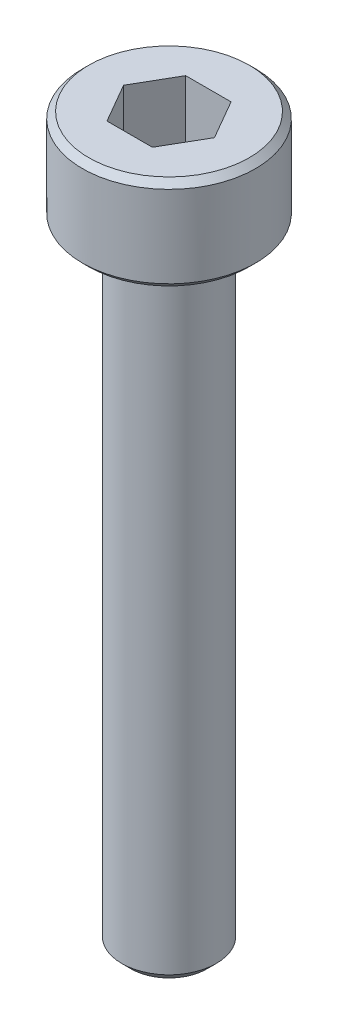
ISO-10303-21;
HEADER;
FILE_DESCRIPTION(('STEP AP214'),'2;1');
FILE_NAME('part.step','',(''),(''),'','','');
FILE_SCHEMA(('AUTOMOTIVE_DESIGN { 1 0 10303 214 1 1 1 1 }'));
ENDSEC;
DATA;
#1=APPLICATION_CONTEXT('core data for automotive mechanical design processes');
#2=APPLICATION_PROTOCOL_DEFINITION('international standard','automotive_design',2000,#1);
#3=PRODUCT_CONTEXT('',#1,'mechanical');
#4=PRODUCT('Part','Part','',(#3));
#5=PRODUCT_RELATED_PRODUCT_CATEGORY('part','',(#4));
#6=PRODUCT_DEFINITION_FORMATION('','',#4);
#7=PRODUCT_DEFINITION_CONTEXT('part definition',#1,'design');
#8=PRODUCT_DEFINITION('design','',#6,#7);
#9=PRODUCT_DEFINITION_SHAPE('','',#8);
#10=(LENGTH_UNIT() NAMED_UNIT(*) SI_UNIT(.MILLI.,.METRE.));
#11=(NAMED_UNIT(*) PLANE_ANGLE_UNIT() SI_UNIT($,.RADIAN.));
#12=(NAMED_UNIT(*) SI_UNIT($,.STERADIAN.) SOLID_ANGLE_UNIT());
#13=UNCERTAINTY_MEASURE_WITH_UNIT(LENGTH_MEASURE(1.E-05),#10,'distance_accuracy_value','');
#14=(GEOMETRIC_REPRESENTATION_CONTEXT(3) GLOBAL_UNCERTAINTY_ASSIGNED_CONTEXT((#13)) GLOBAL_UNIT_ASSIGNED_CONTEXT((#10,
#11,#12)) REPRESENTATION_CONTEXT('',''));
#15=CARTESIAN_POINT('',(0.,0.,0.));
#16=DIRECTION('',(0.,0.,1.));
#17=DIRECTION('',(1.,0.,0.));
#18=AXIS2_PLACEMENT_3D('',#15,#16,#17);
#19=CARTESIAN_POINT('',(0.721687836487033,21.,1.25));
#20=DIRECTION('',(0.866025403784439,0.,0.5));
#21=DIRECTION('',(0.5,0.,-0.866025403784439));
#22=AXIS2_PLACEMENT_3D('',#19,#20,#21);
#23=PLANE('',#22);
#24=DIRECTION('',(0.5,0.,-0.866025403784439));
#25=VECTOR('',#24,1.);
#26=CARTESIAN_POINT('',(0.721687836487033,21.,1.25));
#27=LINE('',#26,#25);
#28=CARTESIAN_POINT('',(0.721687836487033,21.,1.25));
#29=VERTEX_POINT('',#28);
#30=CARTESIAN_POINT('',(1.44337567297406,21.,0.));
#31=VERTEX_POINT('',#30);
#32=EDGE_CURVE('E66',#29,#31,#27,.T.);
#33=ORIENTED_EDGE('',*,*,#32,.F.);
#34=DIRECTION('',(0.,1.,0.));
#35=VECTOR('',#34,1.);
#36=CARTESIAN_POINT('',(0.721687836487033,21.,1.25));
#37=LINE('',#36,#35);
#38=CARTESIAN_POINT('',(0.721687836487033,23.,1.25));
#39=VERTEX_POINT('',#38);
#40=EDGE_CURVE('E85',#29,#39,#37,.T.);
#41=ORIENTED_EDGE('',*,*,#40,.T.);
#42=DIRECTION('',(0.5,0.,-0.866025403784439));
#43=VECTOR('',#42,1.);
#44=CARTESIAN_POINT('',(0.721687836487033,23.,1.25));
#45=LINE('',#44,#43);
#46=CARTESIAN_POINT('',(1.44337567297406,23.,0.));
#47=VERTEX_POINT('',#46);
#48=EDGE_CURVE('E73',#47,#39,#45,.F.);
#49=ORIENTED_EDGE('',*,*,#48,.F.);
#50=DIRECTION('',(0.,1.,0.));
#51=VECTOR('',#50,1.);
#52=CARTESIAN_POINT('',(1.44337567297406,21.,0.));
#53=LINE('',#52,#51);
#54=EDGE_CURVE('E80',#47,#31,#53,.F.);
#55=ORIENTED_EDGE('',*,*,#54,.T.);
#56=EDGE_LOOP('',(#33,#41,#49,#55));
#57=FACE_BOUND('',#56,.T.);
#58=ADVANCED_FACE('F17',(#57),#23,.F.);
#59=CARTESIAN_POINT('',(1.44337567297406,21.,0.));
#60=DIRECTION('',(0.866025403784438,0.,-0.5));
#61=DIRECTION('',(-0.5,0.,-0.866025403784438));
#62=AXIS2_PLACEMENT_3D('',#59,#60,#61);
#63=PLANE('',#62);
#64=DIRECTION('',(-0.5,0.,-0.866025403784438));
#65=VECTOR('',#64,1.);
#66=CARTESIAN_POINT('',(1.44337567297406,21.,0.));
#67=LINE('',#66,#65);
#68=CARTESIAN_POINT('',(0.721687836487031,21.,-1.25));
#69=VERTEX_POINT('',#68);
#70=EDGE_CURVE('E89',#31,#69,#67,.T.);
#71=ORIENTED_EDGE('',*,*,#70,.F.);
#72=ORIENTED_EDGE('',*,*,#54,.F.);
#73=DIRECTION('',(-0.5,0.,-0.866025403784438));
#74=VECTOR('',#73,1.);
#75=CARTESIAN_POINT('',(1.44337567297406,23.,0.));
#76=LINE('',#75,#74);
#77=CARTESIAN_POINT('',(0.721687836487032,23.,-1.25));
#78=VERTEX_POINT('',#77);
#79=EDGE_CURVE('E70',#78,#47,#76,.F.);
#80=ORIENTED_EDGE('',*,*,#79,.F.);
#81=DIRECTION('',(0.,1.,0.));
#82=VECTOR('',#81,1.);
#83=CARTESIAN_POINT('',(0.721687836487031,21.,-1.25));
#84=LINE('',#83,#82);
#85=EDGE_CURVE('E133',#78,#69,#84,.F.);
#86=ORIENTED_EDGE('',*,*,#85,.T.);
#87=EDGE_LOOP('',(#71,#72,#80,#86));
#88=FACE_BOUND('',#87,.T.);
#89=ADVANCED_FACE('F88',(#88),#63,.F.);
#90=CARTESIAN_POINT('',(-0.721687836487032,21.,1.25));
#91=DIRECTION('',(0.,0.,1.));
#92=DIRECTION('',(1.,0.,0.));
#93=AXIS2_PLACEMENT_3D('',#90,#91,#92);
#94=PLANE('',#93);
#95=DIRECTION('',(1.,0.,0.));
#96=VECTOR('',#95,1.);
#97=CARTESIAN_POINT('',(1.44337567297406,21.,1.25));
#98=LINE('',#97,#96);
#99=CARTESIAN_POINT('',(-0.721687836487032,21.,1.25));
#100=VERTEX_POINT('',#99);
#101=EDGE_CURVE('E131',#100,#29,#98,.T.);
#102=ORIENTED_EDGE('',*,*,#101,.F.);
#103=DIRECTION('',(0.,1.,0.));
#104=VECTOR('',#103,1.);
#105=CARTESIAN_POINT('',(-0.721687836487032,21.,1.25));
#106=LINE('',#105,#104);
#107=CARTESIAN_POINT('',(-0.721687836487032,23.,1.25));
#108=VERTEX_POINT('',#107);
#109=EDGE_CURVE('E121',#100,#108,#106,.T.);
#110=ORIENTED_EDGE('',*,*,#109,.T.);
#111=DIRECTION('',(1.,0.,0.));
#112=VECTOR('',#111,1.);
#113=CARTESIAN_POINT('',(-0.721687836487032,23.,1.25));
#114=LINE('',#113,#112);
#115=EDGE_CURVE('E91',#39,#108,#114,.F.);
#116=ORIENTED_EDGE('',*,*,#115,.F.);
#117=ORIENTED_EDGE('',*,*,#40,.F.);
#118=EDGE_LOOP('',(#102,#110,#116,#117));
#119=FACE_BOUND('',#118,.T.);
#120=ADVANCED_FACE('F138',(#119),#94,.F.);
#121=CARTESIAN_POINT('',(0.721687836487031,21.,-1.25));
#122=DIRECTION('',(0.,0.,-1.));
#123=DIRECTION('',(-1.,0.,0.));
#124=AXIS2_PLACEMENT_3D('',#121,#122,#123);
#125=PLANE('',#124);
#126=DIRECTION('',(1.,0.,0.));
#127=VECTOR('',#126,1.);
#128=CARTESIAN_POINT('',(1.44337567297406,21.,-1.25));
#129=LINE('',#128,#127);
#130=CARTESIAN_POINT('',(-0.721687836487032,21.,-1.25));
#131=VERTEX_POINT('',#130);
#132=EDGE_CURVE('E128',#69,#131,#129,.F.);
#133=ORIENTED_EDGE('',*,*,#132,.F.);
#134=ORIENTED_EDGE('',*,*,#85,.F.);
#135=DIRECTION('',(-1.,0.,0.));
#136=VECTOR('',#135,1.);
#137=CARTESIAN_POINT('',(0.721687836487031,23.,-1.25));
#138=LINE('',#137,#136);
#139=CARTESIAN_POINT('',(-0.721687836487032,23.,-1.25));
#140=VERTEX_POINT('',#139);
#141=EDGE_CURVE('E75',#140,#78,#138,.F.);
#142=ORIENTED_EDGE('',*,*,#141,.F.);
#143=DIRECTION('',(0.,1.,0.));
#144=VECTOR('',#143,1.);
#145=CARTESIAN_POINT('',(-0.721687836487032,21.,-1.25));
#146=LINE('',#145,#144);
#147=EDGE_CURVE('E119',#140,#131,#146,.F.);
#148=ORIENTED_EDGE('',*,*,#147,.T.);
#149=EDGE_LOOP('',(#133,#134,#142,#148));
#150=FACE_BOUND('',#149,.T.);
#151=ADVANCED_FACE('F150',(#150),#125,.F.);
#152=CARTESIAN_POINT('',(1.44337567297406,21.,0.));
#153=DIRECTION('',(0.,1.,0.));
#154=DIRECTION('',(0.,0.,1.));
#155=AXIS2_PLACEMENT_3D('',#152,#153,#154);
#156=PLANE('',#155);
#157=ORIENTED_EDGE('',*,*,#132,.T.);
#158=DIRECTION('',(-0.5,0.,0.866025403784439));
#159=VECTOR('',#158,1.);
#160=CARTESIAN_POINT('',(-0.721687836487032,21.,-1.25));
#161=LINE('',#160,#159);
#162=CARTESIAN_POINT('',(-1.44337567297406,21.,0.));
#163=VERTEX_POINT('',#162);
#164=EDGE_CURVE('E117',#131,#163,#161,.T.);
#165=ORIENTED_EDGE('',*,*,#164,.T.);
#166=DIRECTION('',(0.5,0.,0.866025403784438));
#167=VECTOR('',#166,1.);
#168=CARTESIAN_POINT('',(-1.44337567297406,21.,0.));
#169=LINE('',#168,#167);
#170=EDGE_CURVE('E124',#163,#100,#169,.T.);
#171=ORIENTED_EDGE('',*,*,#170,.T.);
#172=ORIENTED_EDGE('',*,*,#101,.T.);
#173=ORIENTED_EDGE('',*,*,#32,.T.);
#174=ORIENTED_EDGE('',*,*,#70,.T.);
#175=EDGE_LOOP('',(#157,#165,#171,#172,#173,#174));
#176=FACE_BOUND('',#175,.T.);
#177=ADVANCED_FACE('F151',(#176),#156,.T.);
#178=CARTESIAN_POINT('',(-1.44337567297406,21.,0.));
#179=DIRECTION('',(-0.866025403784438,0.,0.5));
#180=DIRECTION('',(0.5,0.,0.866025403784438));
#181=AXIS2_PLACEMENT_3D('',#178,#179,#180);
#182=PLANE('',#181);
#183=ORIENTED_EDGE('',*,*,#170,.F.);
#184=DIRECTION('',(0.,1.,0.));
#185=VECTOR('',#184,1.);
#186=CARTESIAN_POINT('',(-1.44337567297407,21.,0.));
#187=LINE('',#186,#185);
#188=CARTESIAN_POINT('',(-1.44337567297406,23.,0.));
#189=VERTEX_POINT('',#188);
#190=EDGE_CURVE('E115',#163,#189,#187,.T.);
#191=ORIENTED_EDGE('',*,*,#190,.T.);
#192=DIRECTION('',(0.5,0.,0.866025403784438));
#193=VECTOR('',#192,1.);
#194=CARTESIAN_POINT('',(-1.44337567297406,23.,0.));
#195=LINE('',#194,#193);
#196=EDGE_CURVE('E35',#108,#189,#195,.F.);
#197=ORIENTED_EDGE('',*,*,#196,.F.);
#198=ORIENTED_EDGE('',*,*,#109,.F.);
#199=EDGE_LOOP('',(#183,#191,#197,#198));
#200=FACE_BOUND('',#199,.T.);
#201=ADVANCED_FACE('F141',(#200),#182,.F.);
#202=CARTESIAN_POINT('',(-0.721687836487032,21.,-1.25));
#203=DIRECTION('',(-0.866025403784439,0.,-0.5));
#204=DIRECTION('',(-0.5,0.,0.866025403784439));
#205=AXIS2_PLACEMENT_3D('',#202,#203,#204);
#206=PLANE('',#205);
#207=ORIENTED_EDGE('',*,*,#164,.F.);
#208=ORIENTED_EDGE('',*,*,#147,.F.);
#209=DIRECTION('',(0.5,0.,-0.866025403784438));
#210=VECTOR('',#209,1.);
#211=CARTESIAN_POINT('',(-1.44337567297406,23.,0.));
#212=LINE('',#211,#210);
#213=EDGE_CURVE('E113',#189,#140,#212,.T.);
#214=ORIENTED_EDGE('',*,*,#213,.F.);
#215=ORIENTED_EDGE('',*,*,#190,.F.);
#216=EDGE_LOOP('',(#207,#208,#214,#215));
#217=FACE_BOUND('',#216,.T.);
#218=ADVANCED_FACE('F147',(#217),#206,.F.);
#219=CARTESIAN_POINT('',(0.,23.,-2.75));
#220=DIRECTION('',(0.,1.,0.));
#221=DIRECTION('',(0.,0.,1.));
#222=AXIS2_PLACEMENT_3D('',#219,#220,#221);
#223=PLANE('',#222);
#224=CARTESIAN_POINT('',(0.,22.9999999999677,0.));
#225=DIRECTION('',(0.,-1.,0.));
#226=DIRECTION('',(0.,0.,-1.));
#227=AXIS2_PLACEMENT_3D('',#224,#225,#226);
#228=CIRCLE('',#227,2.55000000004202);
#229=CARTESIAN_POINT('',(0.,22.9999999999677,-2.55000000004202));
#230=VERTEX_POINT('',#229);
#231=EDGE_CURVE('E20',#230,#230,#228,.T.);
#232=ORIENTED_EDGE('',*,*,#231,.F.);
#233=EDGE_LOOP('',(#232));
#234=FACE_BOUND('',#233,.T.);
#235=ORIENTED_EDGE('',*,*,#196,.T.);
#236=ORIENTED_EDGE('',*,*,#213,.T.);
#237=ORIENTED_EDGE('',*,*,#141,.T.);
#238=ORIENTED_EDGE('',*,*,#79,.T.);
#239=ORIENTED_EDGE('',*,*,#48,.T.);
#240=ORIENTED_EDGE('',*,*,#115,.T.);
#241=EDGE_LOOP('',(#235,#236,#237,#238,#239,#240));
#242=FACE_BOUND('',#241,.T.);
#243=ADVANCED_FACE('F72',(#234,#242),#223,.T.);
#244=CARTESIAN_POINT('',(0.,22.8000000001316,0.));
#245=DIRECTION('',(0.,-1.,0.));
#246=DIRECTION('',(0.,0.,-1.));
#247=AXIS2_PLACEMENT_3D('',#244,#245,#246);
#248=CONICAL_SURFACE('',#247,2.74999999987813,0.785398163397448);
#249=CARTESIAN_POINT('',(0.,22.8,0.));
#250=DIRECTION('',(0.,-1.,0.));
#251=DIRECTION('',(0.,0.,-1.));
#252=AXIS2_PLACEMENT_3D('',#249,#250,#251);
#253=CIRCLE('',#252,2.75);
#254=CARTESIAN_POINT('',(0.,22.8,-2.75));
#255=VERTEX_POINT('',#254);
#256=EDGE_CURVE('E106',#255,#255,#253,.T.);
#257=ORIENTED_EDGE('',*,*,#256,.F.);
#258=EDGE_LOOP('',(#257));
#259=FACE_BOUND('',#258,.T.);
#260=ORIENTED_EDGE('',*,*,#231,.T.);
#261=EDGE_LOOP('',(#260));
#262=FACE_BOUND('',#261,.T.);
#263=ADVANCED_FACE('F186',(#259,#262),#248,.T.);
#264=CARTESIAN_POINT('',(0.,0.,0.));
#265=DIRECTION('',(0.,-1.,0.));
#266=DIRECTION('',(0.,0.,-1.));
#267=AXIS2_PLACEMENT_3D('',#264,#265,#266);
#268=CYLINDRICAL_SURFACE('',#267,2.75);
#269=CARTESIAN_POINT('',(0.,20.1999999999316,0.));
#270=DIRECTION('',(0.,1.,0.));
#271=DIRECTION('',(0.,0.,1.));
#272=AXIS2_PLACEMENT_3D('',#269,#270,#271);
#273=CIRCLE('',#272,2.74999999993497);
#274=CARTESIAN_POINT('',(0.,20.1999999999316,2.74999999993497));
#275=VERTEX_POINT('',#274);
#276=EDGE_CURVE('E102',#275,#275,#273,.F.);
#277=ORIENTED_EDGE('',*,*,#276,.F.);
#278=EDGE_LOOP('',(#277));
#279=FACE_BOUND('',#278,.T.);
#280=ORIENTED_EDGE('',*,*,#256,.T.);
#281=EDGE_LOOP('',(#280));
#282=FACE_BOUND('',#281,.T.);
#283=ADVANCED_FACE('F183',(#279,#282),#268,.T.);
#284=CARTESIAN_POINT('',(0.,20.1999999998179,0.));
#285=DIRECTION('',(0.,1.,0.));
#286=DIRECTION('',(0.,0.,1.));
#287=AXIS2_PLACEMENT_3D('',#284,#285,#286);
#288=CONICAL_SURFACE('',#287,2.74999999982128,0.785398163397448);
#289=ORIENTED_EDGE('',*,*,#276,.T.);
#290=EDGE_LOOP('',(#289));
#291=FACE_BOUND('',#290,.T.);
#292=CARTESIAN_POINT('',(0.,19.999999999925,0.));
#293=DIRECTION('',(0.,1.,0.));
#294=DIRECTION('',(0.,0.,1.));
#295=AXIS2_PLACEMENT_3D('',#292,#293,#294);
#296=CIRCLE('',#295,2.54999999992833);
#297=CARTESIAN_POINT('',(0.,19.999999999925,2.54999999992833));
#298=VERTEX_POINT('',#297);
#299=EDGE_CURVE('E100',#298,#298,#296,.F.);
#300=ORIENTED_EDGE('',*,*,#299,.F.);
#301=EDGE_LOOP('',(#300));
#302=FACE_BOUND('',#301,.T.);
#303=ADVANCED_FACE('F179',(#291,#302),#288,.T.);
#304=CARTESIAN_POINT('',(0.,0.,0.));
#305=DIRECTION('',(0.,-1.,0.));
#306=DIRECTION('',(0.,0.,-1.));
#307=AXIS2_PLACEMENT_3D('',#304,#305,#306);
#308=PLANE('',#307);
#309=CARTESIAN_POINT('',(0.,5.6843418860808E-11,0.));
#310=DIRECTION('',(0.,1.,0.));
#311=DIRECTION('',(0.,0.,1.));
#312=AXIS2_PLACEMENT_3D('',#309,#310,#311);
#313=CIRCLE('',#312,1.20000000003984);
#314=CARTESIAN_POINT('',(0.,5.6843418860808E-11,1.20000000003984));
#315=VERTEX_POINT('',#314);
#316=EDGE_CURVE('E98',#315,#315,#313,.T.);
#317=ORIENTED_EDGE('',*,*,#316,.F.);
#318=EDGE_LOOP('',(#317));
#319=FACE_BOUND('',#318,.T.);
#320=ADVANCED_FACE('F176',(#319),#308,.T.);
#321=CARTESIAN_POINT('',(0.,20.,-1.5));
#322=DIRECTION('',(0.,-1.,0.));
#323=DIRECTION('',(0.,0.,-1.));
#324=AXIS2_PLACEMENT_3D('',#321,#322,#323);
#325=PLANE('',#324);
#326=ORIENTED_EDGE('',*,*,#299,.T.);
#327=EDGE_LOOP('',(#326));
#328=FACE_BOUND('',#327,.T.);
#329=CARTESIAN_POINT('',(0.,20.,0.));
#330=DIRECTION('',(0.,-1.,0.));
#331=DIRECTION('',(0.,0.,-1.));
#332=AXIS2_PLACEMENT_3D('',#329,#330,#331);
#333=CIRCLE('',#332,1.5);
#334=CARTESIAN_POINT('',(0.,20.,-1.5));
#335=VERTEX_POINT('',#334);
#336=EDGE_CURVE('E26',#335,#335,#333,.T.);
#337=ORIENTED_EDGE('',*,*,#336,.F.);
#338=EDGE_LOOP('',(#337));
#339=FACE_BOUND('',#338,.T.);
#340=ADVANCED_FACE('F169',(#328,#339),#325,.T.);
#341=CARTESIAN_POINT('',(0.,0.300000000038381,0.));
#342=DIRECTION('',(0.,1.,0.));
#343=DIRECTION('',(0.,0.,1.));
#344=AXIS2_PLACEMENT_3D('',#341,#342,#343);
#345=CONICAL_SURFACE('',#344,1.50000000002137,0.785398163397448);
#346=CARTESIAN_POINT('',(0.,0.300000000000003,0.));
#347=DIRECTION('',(0.,-1.,0.));
#348=DIRECTION('',(0.,0.,-1.));
#349=AXIS2_PLACEMENT_3D('',#346,#347,#348);
#350=CIRCLE('',#349,1.5);
#351=CARTESIAN_POINT('',(0.,0.300000000000003,-1.5));
#352=VERTEX_POINT('',#351);
#353=EDGE_CURVE('E11',#352,#352,#350,.F.);
#354=ORIENTED_EDGE('',*,*,#353,.F.);
#355=EDGE_LOOP('',(#354));
#356=FACE_BOUND('',#355,.T.);
#357=ORIENTED_EDGE('',*,*,#316,.T.);
#358=EDGE_LOOP('',(#357));
#359=FACE_BOUND('',#358,.T.);
#360=ADVANCED_FACE('F163',(#356,#359),#345,.T.);
#361=CARTESIAN_POINT('',(0.,0.,0.));
#362=DIRECTION('',(0.,-1.,0.));
#363=DIRECTION('',(0.,0.,-1.));
#364=AXIS2_PLACEMENT_3D('',#361,#362,#363);
#365=CYLINDRICAL_SURFACE('',#364,1.5);
#366=ORIENTED_EDGE('',*,*,#353,.T.);
#367=EDGE_LOOP('',(#366));
#368=FACE_BOUND('',#367,.T.);
#369=ORIENTED_EDGE('',*,*,#336,.T.);
#370=EDGE_LOOP('',(#369));
#371=FACE_BOUND('',#370,.T.);
#372=ADVANCED_FACE('F161',(#368,#371),#365,.T.);
#373=CLOSED_SHELL('',(#58,#89,#120,#151,#177,#201,#218,#243,#263,#283,#303,#320,#340,#360,#372));
#374=MANIFOLD_SOLID_BREP('B1',#373);
#375=ADVANCED_BREP_SHAPE_REPRESENTATION('',(#18,#374),#14);
#376=SHAPE_DEFINITION_REPRESENTATION(#9,#375);
ENDSEC;
END-ISO-10303-21;
